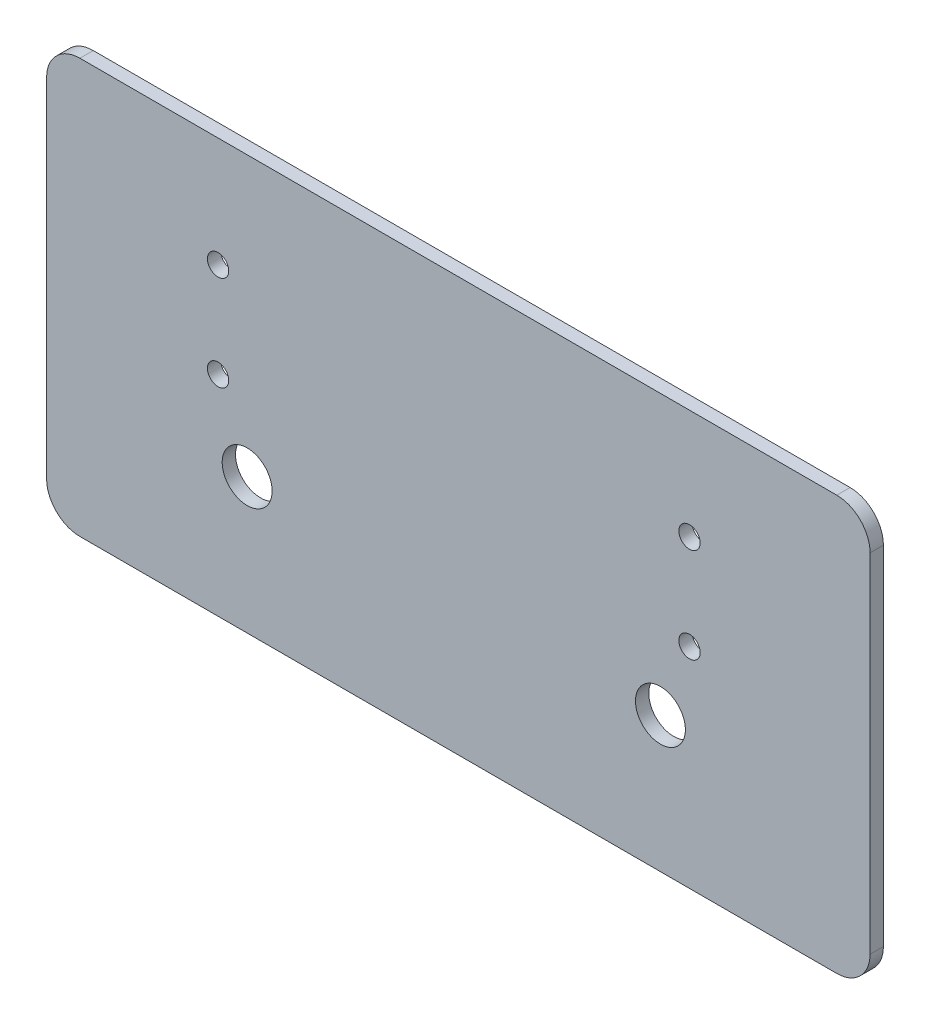
ISO-10303-21;
HEADER;
FILE_DESCRIPTION(('STEP AP214'),'2;1');
FILE_NAME('part.step','',(''),(''),'','','');
FILE_SCHEMA(('AUTOMOTIVE_DESIGN { 1 0 10303 214 1 1 1 1 }'));
ENDSEC;
DATA;
#1=APPLICATION_CONTEXT('core data for automotive mechanical design processes');
#2=APPLICATION_PROTOCOL_DEFINITION('international standard','automotive_design',2000,#1);
#3=PRODUCT_CONTEXT('',#1,'mechanical');
#4=PRODUCT('Part','Part','',(#3));
#5=PRODUCT_RELATED_PRODUCT_CATEGORY('part','',(#4));
#6=PRODUCT_DEFINITION_FORMATION('','',#4);
#7=PRODUCT_DEFINITION_CONTEXT('part definition',#1,'design');
#8=PRODUCT_DEFINITION('design','',#6,#7);
#9=PRODUCT_DEFINITION_SHAPE('','',#8);
#10=(LENGTH_UNIT() NAMED_UNIT(*) SI_UNIT(.MILLI.,.METRE.));
#11=(NAMED_UNIT(*) PLANE_ANGLE_UNIT() SI_UNIT($,.RADIAN.));
#12=(NAMED_UNIT(*) SI_UNIT($,.STERADIAN.) SOLID_ANGLE_UNIT());
#13=UNCERTAINTY_MEASURE_WITH_UNIT(LENGTH_MEASURE(1.E-05),#10,'distance_accuracy_value','');
#14=(GEOMETRIC_REPRESENTATION_CONTEXT(3) GLOBAL_UNCERTAINTY_ASSIGNED_CONTEXT((#13)) GLOBAL_UNIT_ASSIGNED_CONTEXT((#10,
#11,#12)) REPRESENTATION_CONTEXT('',''));
#15=CARTESIAN_POINT('',(0.,0.,0.));
#16=DIRECTION('',(0.,0.,1.));
#17=DIRECTION('',(1.,0.,0.));
#18=AXIS2_PLACEMENT_3D('',#15,#16,#17);
#19=CARTESIAN_POINT('',(98.386811048732,-270.434125192316,4.));
#20=DIRECTION('',(0.,0.,-1.));
#21=DIRECTION('',(-1.,0.,0.));
#22=AXIS2_PLACEMENT_3D('',#19,#20,#21);
#23=CYLINDRICAL_SURFACE('',#22,10.);
#24=CARTESIAN_POINT('',(98.386811048732,-270.434125192316,0.));
#25=DIRECTION('',(0.,0.,1.));
#26=DIRECTION('',(1.,0.,0.));
#27=AXIS2_PLACEMENT_3D('',#24,#25,#26);
#28=CIRCLE('',#27,10.);
#29=CARTESIAN_POINT('',(108.386811048732,-270.434125192316,0.));
#30=VERTEX_POINT('',#29);
#31=CARTESIAN_POINT('',(98.386811048732,-260.434125192316,0.));
#32=VERTEX_POINT('',#31);
#33=EDGE_CURVE('E131',#30,#32,#28,.T.);
#34=ORIENTED_EDGE('',*,*,#33,.T.);
#35=DIRECTION('',(0.,0.,-1.));
#36=VECTOR('',#35,1.);
#37=CARTESIAN_POINT('',(98.386811048732,-260.434125192316,4.));
#38=LINE('',#37,#36);
#39=CARTESIAN_POINT('',(98.386811048732,-260.434125192316,4.));
#40=VERTEX_POINT('',#39);
#41=EDGE_CURVE('E11',#40,#32,#38,.T.);
#42=ORIENTED_EDGE('',*,*,#41,.F.);
#43=CARTESIAN_POINT('',(98.386811048732,-270.434125192316,4.));
#44=DIRECTION('',(0.,0.,1.));
#45=DIRECTION('',(1.,0.,0.));
#46=AXIS2_PLACEMENT_3D('',#43,#44,#45);
#47=CIRCLE('',#46,10.);
#48=CARTESIAN_POINT('',(108.386811048732,-270.434125192316,4.));
#49=VERTEX_POINT('',#48);
#50=EDGE_CURVE('E146',#49,#40,#47,.T.);
#51=ORIENTED_EDGE('',*,*,#50,.F.);
#52=DIRECTION('',(0.,0.,-1.));
#53=VECTOR('',#52,1.);
#54=CARTESIAN_POINT('',(108.386811048732,-270.434125192316,4.));
#55=LINE('',#54,#53);
#56=EDGE_CURVE('E127',#49,#30,#55,.T.);
#57=ORIENTED_EDGE('',*,*,#56,.T.);
#58=EDGE_LOOP('',(#34,#42,#51,#57));
#59=FACE_BOUND('',#58,.T.);
#60=ADVANCED_FACE('F33',(#59),#23,.T.);
#61=CARTESIAN_POINT('',(98.386811048732,-260.434125192316,4.));
#62=DIRECTION('',(0.,-1.,0.));
#63=DIRECTION('',(0.,0.,-1.));
#64=AXIS2_PLACEMENT_3D('',#61,#62,#63);
#65=PLANE('',#64);
#66=DIRECTION('',(-1.,0.,0.));
#67=VECTOR('',#66,1.);
#68=CARTESIAN_POINT('',(98.386811048732,-260.434125192316,0.));
#69=LINE('',#68,#67);
#70=CARTESIAN_POINT('',(-128.910956341261,-260.434125192316,0.));
#71=VERTEX_POINT('',#70);
#72=EDGE_CURVE('E134',#32,#71,#69,.T.);
#73=ORIENTED_EDGE('',*,*,#72,.T.);
#74=DIRECTION('',(0.,0.,-1.));
#75=VECTOR('',#74,1.);
#76=CARTESIAN_POINT('',(-128.910956341261,-260.434125192316,4.));
#77=LINE('',#76,#75);
#78=CARTESIAN_POINT('',(-128.910956341261,-260.434125192316,4.));
#79=VERTEX_POINT('',#78);
#80=EDGE_CURVE('E42',#79,#71,#77,.T.);
#81=ORIENTED_EDGE('',*,*,#80,.F.);
#82=DIRECTION('',(-1.,0.,0.));
#83=VECTOR('',#82,1.);
#84=CARTESIAN_POINT('',(98.386811048732,-260.434125192316,4.));
#85=LINE('',#84,#83);
#86=EDGE_CURVE('E94',#40,#79,#85,.T.);
#87=ORIENTED_EDGE('',*,*,#86,.F.);
#88=ORIENTED_EDGE('',*,*,#41,.T.);
#89=EDGE_LOOP('',(#73,#81,#87,#88));
#90=FACE_BOUND('',#89,.T.);
#91=ADVANCED_FACE('F227',(#90),#65,.F.);
#92=CARTESIAN_POINT('',(-128.910956341261,-270.434125192316,4.));
#93=DIRECTION('',(0.,0.,-1.));
#94=DIRECTION('',(-1.,0.,0.));
#95=AXIS2_PLACEMENT_3D('',#92,#93,#94);
#96=CYLINDRICAL_SURFACE('',#95,10.);
#97=CARTESIAN_POINT('',(-128.910956341261,-270.434125192316,0.));
#98=DIRECTION('',(0.,0.,1.));
#99=DIRECTION('',(1.,0.,0.));
#100=AXIS2_PLACEMENT_3D('',#97,#98,#99);
#101=CIRCLE('',#100,10.);
#102=CARTESIAN_POINT('',(-138.910956341261,-270.434125192316,0.));
#103=VERTEX_POINT('',#102);
#104=EDGE_CURVE('E137',#71,#103,#101,.T.);
#105=ORIENTED_EDGE('',*,*,#104,.T.);
#106=DIRECTION('',(0.,0.,-1.));
#107=VECTOR('',#106,1.);
#108=CARTESIAN_POINT('',(-138.910956341261,-270.434125192316,4.));
#109=LINE('',#108,#107);
#110=CARTESIAN_POINT('',(-138.910956341261,-270.434125192316,4.));
#111=VERTEX_POINT('',#110);
#112=EDGE_CURVE('E153',#111,#103,#109,.T.);
#113=ORIENTED_EDGE('',*,*,#112,.F.);
#114=CARTESIAN_POINT('',(-128.910956341261,-270.434125192316,4.));
#115=DIRECTION('',(0.,0.,1.));
#116=DIRECTION('',(1.,0.,0.));
#117=AXIS2_PLACEMENT_3D('',#114,#115,#116);
#118=CIRCLE('',#117,10.);
#119=EDGE_CURVE('E195',#79,#111,#118,.T.);
#120=ORIENTED_EDGE('',*,*,#119,.F.);
#121=ORIENTED_EDGE('',*,*,#80,.T.);
#122=EDGE_LOOP('',(#105,#113,#120,#121));
#123=FACE_BOUND('',#122,.T.);
#124=ADVANCED_FACE('F231',(#123),#96,.T.);
#125=CARTESIAN_POINT('',(-138.910956341261,-374.82878020031,4.));
#126=DIRECTION('',(1.,0.,0.));
#127=DIRECTION('',(0.,0.,-1.));
#128=AXIS2_PLACEMENT_3D('',#125,#126,#127);
#129=PLANE('',#128);
#130=DIRECTION('',(0.,-1.,0.));
#131=VECTOR('',#130,1.);
#132=CARTESIAN_POINT('',(-138.910956341261,-374.82878020031,0.));
#133=LINE('',#132,#131);
#134=CARTESIAN_POINT('',(-138.910956341261,-374.82878020031,0.));
#135=VERTEX_POINT('',#134);
#136=EDGE_CURVE('E139',#103,#135,#133,.T.);
#137=ORIENTED_EDGE('',*,*,#136,.T.);
#138=DIRECTION('',(0.,0.,-1.));
#139=VECTOR('',#138,1.);
#140=CARTESIAN_POINT('',(-138.910956341261,-374.82878020031,4.));
#141=LINE('',#140,#139);
#142=CARTESIAN_POINT('',(-138.910956341261,-374.82878020031,4.));
#143=VERTEX_POINT('',#142);
#144=EDGE_CURVE('E150',#143,#135,#141,.T.);
#145=ORIENTED_EDGE('',*,*,#144,.F.);
#146=DIRECTION('',(0.,-1.,0.));
#147=VECTOR('',#146,1.);
#148=CARTESIAN_POINT('',(-138.910956341261,-374.82878020031,4.));
#149=LINE('',#148,#147);
#150=EDGE_CURVE('E197',#111,#143,#149,.T.);
#151=ORIENTED_EDGE('',*,*,#150,.F.);
#152=ORIENTED_EDGE('',*,*,#112,.T.);
#153=EDGE_LOOP('',(#137,#145,#151,#152));
#154=FACE_BOUND('',#153,.T.);
#155=ADVANCED_FACE('F203',(#154),#129,.F.);
#156=CARTESIAN_POINT('',(-128.910956341261,-374.82878020031,4.));
#157=DIRECTION('',(0.,0.,-1.));
#158=DIRECTION('',(-1.,0.,0.));
#159=AXIS2_PLACEMENT_3D('',#156,#157,#158);
#160=CYLINDRICAL_SURFACE('',#159,10.);
#161=CARTESIAN_POINT('',(-128.910956341261,-374.82878020031,0.));
#162=DIRECTION('',(0.,0.,1.));
#163=DIRECTION('',(-1.,0.,0.));
#164=AXIS2_PLACEMENT_3D('',#161,#162,#163);
#165=CIRCLE('',#164,10.);
#166=CARTESIAN_POINT('',(-128.910956341261,-384.82878020031,0.));
#167=VERTEX_POINT('',#166);
#168=EDGE_CURVE('E141',#135,#167,#165,.T.);
#169=ORIENTED_EDGE('',*,*,#168,.T.);
#170=DIRECTION('',(0.,0.,-1.));
#171=VECTOR('',#170,1.);
#172=CARTESIAN_POINT('',(-128.910956341261,-384.82878020031,4.));
#173=LINE('',#172,#171);
#174=CARTESIAN_POINT('',(-128.910956341261,-384.82878020031,4.));
#175=VERTEX_POINT('',#174);
#176=EDGE_CURVE('E122',#175,#167,#173,.T.);
#177=ORIENTED_EDGE('',*,*,#176,.F.);
#178=CARTESIAN_POINT('',(-128.910956341261,-374.82878020031,4.));
#179=DIRECTION('',(0.,0.,1.));
#180=DIRECTION('',(-1.,0.,0.));
#181=AXIS2_PLACEMENT_3D('',#178,#179,#180);
#182=CIRCLE('',#181,10.);
#183=EDGE_CURVE('E113',#143,#175,#182,.T.);
#184=ORIENTED_EDGE('',*,*,#183,.F.);
#185=ORIENTED_EDGE('',*,*,#144,.T.);
#186=EDGE_LOOP('',(#169,#177,#184,#185));
#187=FACE_BOUND('',#186,.T.);
#188=ADVANCED_FACE('F207',(#187),#160,.T.);
#189=CARTESIAN_POINT('',(98.386811048732,-384.82878020031,4.));
#190=DIRECTION('',(0.,1.,0.));
#191=DIRECTION('',(0.,0.,1.));
#192=AXIS2_PLACEMENT_3D('',#189,#190,#191);
#193=PLANE('',#192);
#194=DIRECTION('',(1.,0.,0.));
#195=VECTOR('',#194,1.);
#196=CARTESIAN_POINT('',(98.386811048732,-384.82878020031,0.));
#197=LINE('',#196,#195);
#198=CARTESIAN_POINT('',(98.386811048732,-384.82878020031,0.));
#199=VERTEX_POINT('',#198);
#200=EDGE_CURVE('E121',#167,#199,#197,.T.);
#201=ORIENTED_EDGE('',*,*,#200,.T.);
#202=DIRECTION('',(0.,0.,-1.));
#203=VECTOR('',#202,1.);
#204=CARTESIAN_POINT('',(98.386811048732,-384.82878020031,4.));
#205=LINE('',#204,#203);
#206=CARTESIAN_POINT('',(98.386811048732,-384.82878020031,4.));
#207=VERTEX_POINT('',#206);
#208=EDGE_CURVE('E118',#207,#199,#205,.T.);
#209=ORIENTED_EDGE('',*,*,#208,.F.);
#210=DIRECTION('',(1.,0.,0.));
#211=VECTOR('',#210,1.);
#212=CARTESIAN_POINT('',(98.386811048732,-384.82878020031,4.));
#213=LINE('',#212,#211);
#214=EDGE_CURVE('E107',#175,#207,#213,.T.);
#215=ORIENTED_EDGE('',*,*,#214,.F.);
#216=ORIENTED_EDGE('',*,*,#176,.T.);
#217=EDGE_LOOP('',(#201,#209,#215,#216));
#218=FACE_BOUND('',#217,.T.);
#219=ADVANCED_FACE('F119',(#218),#193,.F.);
#220=CARTESIAN_POINT('',(98.386811048732,-374.82878020031,4.));
#221=DIRECTION('',(0.,0.,-1.));
#222=DIRECTION('',(-1.,0.,0.));
#223=AXIS2_PLACEMENT_3D('',#220,#221,#222);
#224=CYLINDRICAL_SURFACE('',#223,10.);
#225=CARTESIAN_POINT('',(98.386811048732,-374.82878020031,0.));
#226=DIRECTION('',(0.,0.,1.));
#227=DIRECTION('',(1.,0.,0.));
#228=AXIS2_PLACEMENT_3D('',#225,#226,#227);
#229=CIRCLE('',#228,10.);
#230=CARTESIAN_POINT('',(108.386811048732,-374.82878020031,0.));
#231=VERTEX_POINT('',#230);
#232=EDGE_CURVE('E80',#199,#231,#229,.T.);
#233=ORIENTED_EDGE('',*,*,#232,.T.);
#234=DIRECTION('',(0.,0.,-1.));
#235=VECTOR('',#234,1.);
#236=CARTESIAN_POINT('',(108.386811048732,-374.82878020031,4.));
#237=LINE('',#236,#235);
#238=CARTESIAN_POINT('',(108.386811048732,-374.82878020031,4.));
#239=VERTEX_POINT('',#238);
#240=EDGE_CURVE('E123',#239,#231,#237,.T.);
#241=ORIENTED_EDGE('',*,*,#240,.F.);
#242=CARTESIAN_POINT('',(98.386811048732,-374.82878020031,4.));
#243=DIRECTION('',(0.,0.,1.));
#244=DIRECTION('',(1.,0.,0.));
#245=AXIS2_PLACEMENT_3D('',#242,#243,#244);
#246=CIRCLE('',#245,10.);
#247=EDGE_CURVE('E111',#207,#239,#246,.T.);
#248=ORIENTED_EDGE('',*,*,#247,.F.);
#249=ORIENTED_EDGE('',*,*,#208,.T.);
#250=EDGE_LOOP('',(#233,#241,#248,#249));
#251=FACE_BOUND('',#250,.T.);
#252=ADVANCED_FACE('F125',(#251),#224,.T.);
#253=CARTESIAN_POINT('',(108.386811048732,-374.82878020031,4.));
#254=DIRECTION('',(-1.,0.,0.));
#255=DIRECTION('',(0.,0.,1.));
#256=AXIS2_PLACEMENT_3D('',#253,#254,#255);
#257=PLANE('',#256);
#258=DIRECTION('',(0.,1.,0.));
#259=VECTOR('',#258,1.);
#260=CARTESIAN_POINT('',(108.386811048732,-374.82878020031,0.));
#261=LINE('',#260,#259);
#262=EDGE_CURVE('E86',#231,#30,#261,.T.);
#263=ORIENTED_EDGE('',*,*,#262,.T.);
#264=ORIENTED_EDGE('',*,*,#56,.F.);
#265=DIRECTION('',(0.,1.,0.));
#266=VECTOR('',#265,1.);
#267=CARTESIAN_POINT('',(108.386811048732,-374.82878020031,4.));
#268=LINE('',#267,#266);
#269=EDGE_CURVE('E51',#239,#49,#268,.T.);
#270=ORIENTED_EDGE('',*,*,#269,.F.);
#271=ORIENTED_EDGE('',*,*,#240,.T.);
#272=EDGE_LOOP('',(#263,#264,#270,#271));
#273=FACE_BOUND('',#272,.T.);
#274=ADVANCED_FACE('F215',(#273),#257,.F.);
#275=CARTESIAN_POINT('',(98.386811048732,-270.434125192316,4.));
#276=DIRECTION('',(0.,0.,1.));
#277=DIRECTION('',(1.,0.,0.));
#278=AXIS2_PLACEMENT_3D('',#275,#276,#277);
#279=PLANE('',#278);
#280=CARTESIAN_POINT('',(45.4264270076822,-344.165502046719,4.));
#281=DIRECTION('',(0.,0.,1.));
#282=DIRECTION('',(1.,0.,0.));
#283=AXIS2_PLACEMENT_3D('',#280,#281,#282);
#284=CIRCLE('',#283,7.5);
#285=CARTESIAN_POINT('',(52.9264270076822,-344.165502046719,4.));
#286=VERTEX_POINT('',#285);
#287=EDGE_CURVE('E171',#286,#286,#284,.T.);
#288=ORIENTED_EDGE('',*,*,#287,.F.);
#289=EDGE_LOOP('',(#288));
#290=FACE_BOUND('',#289,.T.);
#291=CARTESIAN_POINT('',(-78.6810147876822,-344.165502046719,4.));
#292=DIRECTION('',(0.,0.,1.));
#293=DIRECTION('',(1.,0.,0.));
#294=AXIS2_PLACEMENT_3D('',#291,#292,#293);
#295=CIRCLE('',#294,7.50000000000001);
#296=CARTESIAN_POINT('',(-71.1810147876822,-344.165502046719,4.));
#297=VERTEX_POINT('',#296);
#298=EDGE_CURVE('E160',#297,#297,#295,.T.);
#299=ORIENTED_EDGE('',*,*,#298,.F.);
#300=EDGE_LOOP('',(#299));
#301=FACE_BOUND('',#300,.T.);
#302=CARTESIAN_POINT('',(54.16270611,-293.415681156461,4.));
#303=DIRECTION('',(0.,0.,1.));
#304=DIRECTION('',(1.,0.,0.));
#305=AXIS2_PLACEMENT_3D('',#302,#303,#304);
#306=CIRCLE('',#305,3.2);
#307=CARTESIAN_POINT('',(57.36270611,-293.415681156461,4.));
#308=VERTEX_POINT('',#307);
#309=EDGE_CURVE('E159',#308,#308,#306,.T.);
#310=ORIENTED_EDGE('',*,*,#309,.F.);
#311=EDGE_LOOP('',(#310));
#312=FACE_BOUND('',#311,.T.);
#313=CARTESIAN_POINT('',(54.16270611,-321.91568115646,4.));
#314=DIRECTION('',(0.,0.,1.));
#315=DIRECTION('',(1.,0.,0.));
#316=AXIS2_PLACEMENT_3D('',#313,#314,#315);
#317=CIRCLE('',#316,3.2);
#318=CARTESIAN_POINT('',(57.36270611,-321.91568115646,4.));
#319=VERTEX_POINT('',#318);
#320=EDGE_CURVE('E176',#319,#319,#317,.T.);
#321=ORIENTED_EDGE('',*,*,#320,.F.);
#322=EDGE_LOOP('',(#321));
#323=FACE_BOUND('',#322,.T.);
#324=CARTESIAN_POINT('',(-87.41729389,-321.91568115646,4.));
#325=DIRECTION('',(0.,0.,1.));
#326=DIRECTION('',(1.,0.,0.));
#327=AXIS2_PLACEMENT_3D('',#324,#325,#326);
#328=CIRCLE('',#327,3.19999999999999);
#329=CARTESIAN_POINT('',(-84.21729389,-321.91568115646,4.));
#330=VERTEX_POINT('',#329);
#331=EDGE_CURVE('E182',#330,#330,#328,.T.);
#332=ORIENTED_EDGE('',*,*,#331,.F.);
#333=EDGE_LOOP('',(#332));
#334=FACE_BOUND('',#333,.T.);
#335=CARTESIAN_POINT('',(-87.41729389,-293.415681156461,4.));
#336=DIRECTION('',(0.,0.,1.));
#337=DIRECTION('',(1.,0.,0.));
#338=AXIS2_PLACEMENT_3D('',#335,#336,#337);
#339=CIRCLE('',#338,3.19999999999999);
#340=CARTESIAN_POINT('',(-84.21729389,-293.415681156461,4.));
#341=VERTEX_POINT('',#340);
#342=EDGE_CURVE('E188',#341,#341,#339,.T.);
#343=ORIENTED_EDGE('',*,*,#342,.F.);
#344=EDGE_LOOP('',(#343));
#345=FACE_BOUND('',#344,.T.);
#346=ORIENTED_EDGE('',*,*,#50,.T.);
#347=ORIENTED_EDGE('',*,*,#86,.T.);
#348=ORIENTED_EDGE('',*,*,#119,.T.);
#349=ORIENTED_EDGE('',*,*,#150,.T.);
#350=ORIENTED_EDGE('',*,*,#183,.T.);
#351=ORIENTED_EDGE('',*,*,#214,.T.);
#352=ORIENTED_EDGE('',*,*,#247,.T.);
#353=ORIENTED_EDGE('',*,*,#269,.T.);
#354=EDGE_LOOP('',(#346,#347,#348,#349,#350,#351,#352,#353));
#355=FACE_BOUND('',#354,.T.);
#356=ADVANCED_FACE('F109',(#290,#301,#312,#323,#334,#345,#355),#279,.T.);
#357=CARTESIAN_POINT('',(98.386811048732,-270.434125192316,0.));
#358=DIRECTION('',(0.,0.,1.));
#359=DIRECTION('',(1.,0.,0.));
#360=AXIS2_PLACEMENT_3D('',#357,#358,#359);
#361=PLANE('',#360);
#362=CARTESIAN_POINT('',(45.4264270076822,-344.165502046719,0.));
#363=DIRECTION('',(0.,0.,1.));
#364=DIRECTION('',(1.,0.,0.));
#365=AXIS2_PLACEMENT_3D('',#362,#363,#364);
#366=CIRCLE('',#365,7.5);
#367=CARTESIAN_POINT('',(52.9264270076822,-344.165502046719,0.));
#368=VERTEX_POINT('',#367);
#369=EDGE_CURVE('E36',#368,#368,#366,.T.);
#370=ORIENTED_EDGE('',*,*,#369,.T.);
#371=EDGE_LOOP('',(#370));
#372=FACE_BOUND('',#371,.T.);
#373=CARTESIAN_POINT('',(-78.6810147876822,-344.165502046719,0.));
#374=DIRECTION('',(0.,0.,1.));
#375=DIRECTION('',(1.,0.,0.));
#376=AXIS2_PLACEMENT_3D('',#373,#374,#375);
#377=CIRCLE('',#376,7.50000000000001);
#378=CARTESIAN_POINT('',(-71.1810147876822,-344.165502046719,0.));
#379=VERTEX_POINT('',#378);
#380=EDGE_CURVE('E157',#379,#379,#377,.T.);
#381=ORIENTED_EDGE('',*,*,#380,.T.);
#382=EDGE_LOOP('',(#381));
#383=FACE_BOUND('',#382,.T.);
#384=CARTESIAN_POINT('',(54.16270611,-293.415681156461,0.));
#385=DIRECTION('',(0.,0.,1.));
#386=DIRECTION('',(1.,0.,0.));
#387=AXIS2_PLACEMENT_3D('',#384,#385,#386);
#388=CIRCLE('',#387,3.2);
#389=CARTESIAN_POINT('',(57.36270611,-293.415681156461,0.));
#390=VERTEX_POINT('',#389);
#391=EDGE_CURVE('E164',#390,#390,#388,.T.);
#392=ORIENTED_EDGE('',*,*,#391,.T.);
#393=EDGE_LOOP('',(#392));
#394=FACE_BOUND('',#393,.T.);
#395=CARTESIAN_POINT('',(54.16270611,-321.91568115646,0.));
#396=DIRECTION('',(0.,0.,1.));
#397=DIRECTION('',(1.,0.,0.));
#398=AXIS2_PLACEMENT_3D('',#395,#396,#397);
#399=CIRCLE('',#398,3.2);
#400=CARTESIAN_POINT('',(57.36270611,-321.91568115646,0.));
#401=VERTEX_POINT('',#400);
#402=EDGE_CURVE('E179',#401,#401,#399,.T.);
#403=ORIENTED_EDGE('',*,*,#402,.T.);
#404=EDGE_LOOP('',(#403));
#405=FACE_BOUND('',#404,.T.);
#406=CARTESIAN_POINT('',(-87.41729389,-321.91568115646,0.));
#407=DIRECTION('',(0.,0.,1.));
#408=DIRECTION('',(1.,0.,0.));
#409=AXIS2_PLACEMENT_3D('',#406,#407,#408);
#410=CIRCLE('',#409,3.19999999999999);
#411=CARTESIAN_POINT('',(-84.21729389,-321.91568115646,0.));
#412=VERTEX_POINT('',#411);
#413=EDGE_CURVE('E185',#412,#412,#410,.T.);
#414=ORIENTED_EDGE('',*,*,#413,.T.);
#415=EDGE_LOOP('',(#414));
#416=FACE_BOUND('',#415,.T.);
#417=CARTESIAN_POINT('',(-87.41729389,-293.415681156461,0.));
#418=DIRECTION('',(0.,0.,1.));
#419=DIRECTION('',(1.,0.,0.));
#420=AXIS2_PLACEMENT_3D('',#417,#418,#419);
#421=CIRCLE('',#420,3.19999999999999);
#422=CARTESIAN_POINT('',(-84.21729389,-293.415681156461,0.));
#423=VERTEX_POINT('',#422);
#424=EDGE_CURVE('E135',#423,#423,#421,.T.);
#425=ORIENTED_EDGE('',*,*,#424,.T.);
#426=EDGE_LOOP('',(#425));
#427=FACE_BOUND('',#426,.T.);
#428=ORIENTED_EDGE('',*,*,#33,.F.);
#429=ORIENTED_EDGE('',*,*,#262,.F.);
#430=ORIENTED_EDGE('',*,*,#232,.F.);
#431=ORIENTED_EDGE('',*,*,#200,.F.);
#432=ORIENTED_EDGE('',*,*,#168,.F.);
#433=ORIENTED_EDGE('',*,*,#136,.F.);
#434=ORIENTED_EDGE('',*,*,#104,.F.);
#435=ORIENTED_EDGE('',*,*,#72,.F.);
#436=EDGE_LOOP('',(#428,#429,#430,#431,#432,#433,#434,#435));
#437=FACE_BOUND('',#436,.T.);
#438=ADVANCED_FACE('F210',(#372,#383,#394,#405,#416,#427,#437),#361,.F.);
#439=CARTESIAN_POINT('',(-87.41729389,-293.415681156461,4.));
#440=DIRECTION('',(0.,0.,1.));
#441=DIRECTION('',(1.,0.,0.));
#442=AXIS2_PLACEMENT_3D('',#439,#440,#441);
#443=CYLINDRICAL_SURFACE('',#442,3.19999999999999);
#444=ORIENTED_EDGE('',*,*,#424,.F.);
#445=EDGE_LOOP('',(#444));
#446=FACE_BOUND('',#445,.T.);
#447=ORIENTED_EDGE('',*,*,#342,.T.);
#448=EDGE_LOOP('',(#447));
#449=FACE_BOUND('',#448,.T.);
#450=ADVANCED_FACE('F261',(#446,#449),#443,.F.);
#451=CARTESIAN_POINT('',(-87.41729389,-321.91568115646,4.));
#452=DIRECTION('',(0.,0.,1.));
#453=DIRECTION('',(1.,0.,0.));
#454=AXIS2_PLACEMENT_3D('',#451,#452,#453);
#455=CYLINDRICAL_SURFACE('',#454,3.19999999999999);
#456=ORIENTED_EDGE('',*,*,#413,.F.);
#457=EDGE_LOOP('',(#456));
#458=FACE_BOUND('',#457,.T.);
#459=ORIENTED_EDGE('',*,*,#331,.T.);
#460=EDGE_LOOP('',(#459));
#461=FACE_BOUND('',#460,.T.);
#462=ADVANCED_FACE('F266',(#458,#461),#455,.F.);
#463=CARTESIAN_POINT('',(54.16270611,-321.91568115646,4.));
#464=DIRECTION('',(0.,0.,1.));
#465=DIRECTION('',(1.,0.,0.));
#466=AXIS2_PLACEMENT_3D('',#463,#464,#465);
#467=CYLINDRICAL_SURFACE('',#466,3.2);
#468=ORIENTED_EDGE('',*,*,#402,.F.);
#469=EDGE_LOOP('',(#468));
#470=FACE_BOUND('',#469,.T.);
#471=ORIENTED_EDGE('',*,*,#320,.T.);
#472=EDGE_LOOP('',(#471));
#473=FACE_BOUND('',#472,.T.);
#474=ADVANCED_FACE('F278',(#470,#473),#467,.F.);
#475=CARTESIAN_POINT('',(54.16270611,-293.415681156461,4.));
#476=DIRECTION('',(0.,0.,1.));
#477=DIRECTION('',(1.,0.,0.));
#478=AXIS2_PLACEMENT_3D('',#475,#476,#477);
#479=CYLINDRICAL_SURFACE('',#478,3.2);
#480=ORIENTED_EDGE('',*,*,#391,.F.);
#481=EDGE_LOOP('',(#480));
#482=FACE_BOUND('',#481,.T.);
#483=ORIENTED_EDGE('',*,*,#309,.T.);
#484=EDGE_LOOP('',(#483));
#485=FACE_BOUND('',#484,.T.);
#486=ADVANCED_FACE('F288',(#482,#485),#479,.F.);
#487=CARTESIAN_POINT('',(-78.6810147876822,-344.165502046719,-36.678061402546));
#488=DIRECTION('',(0.,0.,1.));
#489=DIRECTION('',(1.,0.,0.));
#490=AXIS2_PLACEMENT_3D('',#487,#488,#489);
#491=CYLINDRICAL_SURFACE('',#490,7.50000000000001);
#492=ORIENTED_EDGE('',*,*,#298,.T.);
#493=EDGE_LOOP('',(#492));
#494=FACE_BOUND('',#493,.T.);
#495=ORIENTED_EDGE('',*,*,#380,.F.);
#496=EDGE_LOOP('',(#495));
#497=FACE_BOUND('',#496,.T.);
#498=ADVANCED_FACE('F298',(#494,#497),#491,.F.);
#499=CARTESIAN_POINT('',(45.4264270076822,-344.165502046719,-36.678061402546));
#500=DIRECTION('',(0.,0.,1.));
#501=DIRECTION('',(1.,0.,0.));
#502=AXIS2_PLACEMENT_3D('',#499,#500,#501);
#503=CYLINDRICAL_SURFACE('',#502,7.5);
#504=ORIENTED_EDGE('',*,*,#287,.T.);
#505=EDGE_LOOP('',(#504));
#506=FACE_BOUND('',#505,.T.);
#507=ORIENTED_EDGE('',*,*,#369,.F.);
#508=EDGE_LOOP('',(#507));
#509=FACE_BOUND('',#508,.T.);
#510=ADVANCED_FACE('F319',(#506,#509),#503,.F.);
#511=CLOSED_SHELL('',(#60,#91,#124,#155,#188,#219,#252,#274,#356,#438,#450,#462,#474,#486,#498,#510));
#512=MANIFOLD_SOLID_BREP('B2',#511);
#513=ADVANCED_BREP_SHAPE_REPRESENTATION('',(#18,#512),#14);
#514=SHAPE_DEFINITION_REPRESENTATION(#9,#513);
ENDSEC;
END-ISO-10303-21;
